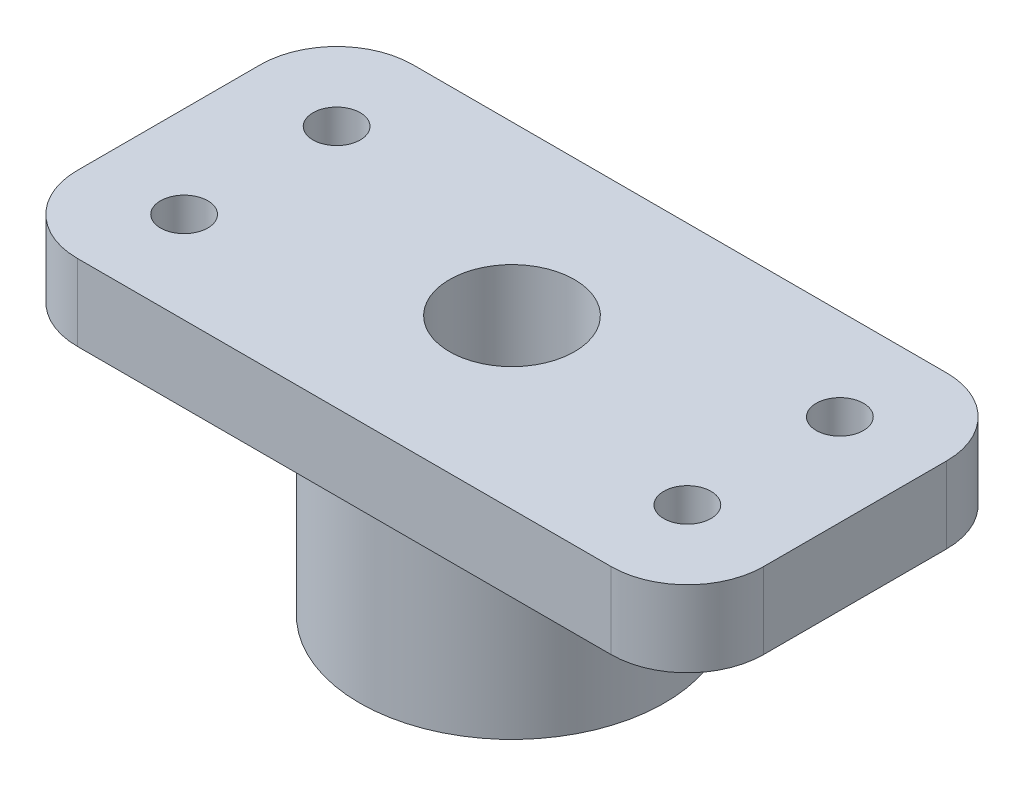
ISO-10303-21;
HEADER;
FILE_DESCRIPTION(('STEP AP214'),'2;1');
FILE_NAME('part.step','',(''),(''),'','','');
FILE_SCHEMA(('AUTOMOTIVE_DESIGN { 1 0 10303 214 1 1 1 1 }'));
ENDSEC;
DATA;
#1=APPLICATION_CONTEXT('core data for automotive mechanical design processes');
#2=APPLICATION_PROTOCOL_DEFINITION('international standard','automotive_design',2000,#1);
#3=PRODUCT_CONTEXT('',#1,'mechanical');
#4=PRODUCT('Part','Part','',(#3));
#5=PRODUCT_RELATED_PRODUCT_CATEGORY('part','',(#4));
#6=PRODUCT_DEFINITION_FORMATION('','',#4);
#7=PRODUCT_DEFINITION_CONTEXT('part definition',#1,'design');
#8=PRODUCT_DEFINITION('design','',#6,#7);
#9=PRODUCT_DEFINITION_SHAPE('','',#8);
#10=(LENGTH_UNIT() NAMED_UNIT(*) SI_UNIT(.MILLI.,.METRE.));
#11=(NAMED_UNIT(*) PLANE_ANGLE_UNIT() SI_UNIT($,.RADIAN.));
#12=(NAMED_UNIT(*) SI_UNIT($,.STERADIAN.) SOLID_ANGLE_UNIT());
#13=UNCERTAINTY_MEASURE_WITH_UNIT(LENGTH_MEASURE(1.E-05),#10,'distance_accuracy_value','');
#14=(GEOMETRIC_REPRESENTATION_CONTEXT(3) GLOBAL_UNCERTAINTY_ASSIGNED_CONTEXT((#13)) GLOBAL_UNIT_ASSIGNED_CONTEXT((#10,
#11,#12)) REPRESENTATION_CONTEXT('',''));
#15=CARTESIAN_POINT('',(0.,0.,0.));
#16=DIRECTION('',(0.,0.,1.));
#17=DIRECTION('',(1.,0.,0.));
#18=AXIS2_PLACEMENT_3D('',#15,#16,#17);
#19=CARTESIAN_POINT('',(0.,0.,0.));
#20=DIRECTION('',(0.,1.,0.));
#21=DIRECTION('',(0.,0.,1.));
#22=AXIS2_PLACEMENT_3D('',#19,#20,#21);
#23=PLANE('',#22);
#24=CARTESIAN_POINT('',(0.,0.,0.));
#25=DIRECTION('',(0.,-1.,0.));
#26=DIRECTION('',(0.,0.,-1.));
#27=AXIS2_PLACEMENT_3D('',#24,#25,#26);
#28=CIRCLE('',#27,4.1);
#29=CARTESIAN_POINT('',(0.,0.,-4.1));
#30=VERTEX_POINT('',#29);
#31=EDGE_CURVE('E164',#30,#30,#28,.T.);
#32=ORIENTED_EDGE('',*,*,#31,.F.);
#33=EDGE_LOOP('',(#32));
#34=FACE_BOUND('',#33,.T.);
#35=CARTESIAN_POINT('',(0.,0.,0.));
#36=DIRECTION('',(0.,1.,0.));
#37=DIRECTION('',(0.,0.,1.));
#38=AXIS2_PLACEMENT_3D('',#35,#36,#37);
#39=CIRCLE('',#38,10.);
#40=CARTESIAN_POINT('',(0.,0.,10.));
#41=VERTEX_POINT('',#40);
#42=EDGE_CURVE('E127',#41,#41,#39,.T.);
#43=ORIENTED_EDGE('',*,*,#42,.F.);
#44=EDGE_LOOP('',(#43));
#45=FACE_BOUND('',#44,.T.);
#46=ADVANCED_FACE('F32',(#34,#45),#23,.F.);
#47=CARTESIAN_POINT('',(0.,12.,0.));
#48=DIRECTION('',(0.,-1.,0.));
#49=DIRECTION('',(0.,0.,-1.));
#50=AXIS2_PLACEMENT_3D('',#47,#48,#49);
#51=CYLINDRICAL_SURFACE('',#50,10.);
#52=CARTESIAN_POINT('',(0.,12.,0.));
#53=DIRECTION('',(0.,1.,0.));
#54=DIRECTION('',(0.,0.,1.));
#55=AXIS2_PLACEMENT_3D('',#52,#53,#54);
#56=CIRCLE('',#55,10.);
#57=CARTESIAN_POINT('',(0.,12.,10.));
#58=VERTEX_POINT('',#57);
#59=EDGE_CURVE('E112',#58,#58,#56,.T.);
#60=ORIENTED_EDGE('',*,*,#59,.F.);
#61=EDGE_LOOP('',(#60));
#62=FACE_BOUND('',#61,.T.);
#63=ORIENTED_EDGE('',*,*,#42,.T.);
#64=EDGE_LOOP('',(#63));
#65=FACE_BOUND('',#64,.T.);
#66=ADVANCED_FACE('F228',(#62,#65),#51,.T.);
#67=CARTESIAN_POINT('',(0.,12.,0.));
#68=DIRECTION('',(0.,-1.,0.));
#69=DIRECTION('',(0.,0.,-1.));
#70=AXIS2_PLACEMENT_3D('',#67,#68,#69);
#71=PLANE('',#70);
#72=CARTESIAN_POINT('',(16.5,12.,-5.));
#73=DIRECTION('',(0.,-1.,0.));
#74=DIRECTION('',(0.,0.,-1.));
#75=AXIS2_PLACEMENT_3D('',#72,#73,#74);
#76=CIRCLE('',#75,1.55);
#77=CARTESIAN_POINT('',(16.5,12.,-6.55000000000001));
#78=VERTEX_POINT('',#77);
#79=EDGE_CURVE('E184',#78,#78,#76,.T.);
#80=ORIENTED_EDGE('',*,*,#79,.F.);
#81=EDGE_LOOP('',(#80));
#82=FACE_BOUND('',#81,.T.);
#83=CARTESIAN_POINT('',(16.5,12.,5.));
#84=DIRECTION('',(0.,-1.,0.));
#85=DIRECTION('',(0.,0.,-1.));
#86=AXIS2_PLACEMENT_3D('',#83,#84,#85);
#87=CIRCLE('',#86,1.55);
#88=CARTESIAN_POINT('',(16.5,12.,3.44999999999999));
#89=VERTEX_POINT('',#88);
#90=EDGE_CURVE('E174',#89,#89,#87,.T.);
#91=ORIENTED_EDGE('',*,*,#90,.F.);
#92=EDGE_LOOP('',(#91));
#93=FACE_BOUND('',#92,.T.);
#94=CARTESIAN_POINT('',(-16.5,12.,-5.));
#95=DIRECTION('',(0.,-1.,0.));
#96=DIRECTION('',(0.,0.,-1.));
#97=AXIS2_PLACEMENT_3D('',#94,#95,#96);
#98=CIRCLE('',#97,1.55);
#99=CARTESIAN_POINT('',(-16.5,12.,-6.55));
#100=VERTEX_POINT('',#99);
#101=EDGE_CURVE('E171',#100,#100,#98,.T.);
#102=ORIENTED_EDGE('',*,*,#101,.F.);
#103=EDGE_LOOP('',(#102));
#104=FACE_BOUND('',#103,.T.);
#105=CARTESIAN_POINT('',(-16.5,12.,5.));
#106=DIRECTION('',(0.,-1.,0.));
#107=DIRECTION('',(0.,0.,-1.));
#108=AXIS2_PLACEMENT_3D('',#105,#106,#107);
#109=CIRCLE('',#108,1.55);
#110=CARTESIAN_POINT('',(-16.5,12.,3.45));
#111=VERTEX_POINT('',#110);
#112=EDGE_CURVE('E168',#111,#111,#109,.T.);
#113=ORIENTED_EDGE('',*,*,#112,.F.);
#114=EDGE_LOOP('',(#113));
#115=FACE_BOUND('',#114,.T.);
#116=DIRECTION('',(0.,0.,1.));
#117=VECTOR('',#116,1.);
#118=CARTESIAN_POINT('',(-22.5,12.,-11.));
#119=LINE('',#118,#117);
#120=CARTESIAN_POINT('',(-22.5,12.,-6.));
#121=VERTEX_POINT('',#120);
#122=CARTESIAN_POINT('',(-22.5,12.,6.));
#123=VERTEX_POINT('',#122);
#124=EDGE_CURVE('E163',#121,#123,#119,.T.);
#125=ORIENTED_EDGE('',*,*,#124,.F.);
#126=CARTESIAN_POINT('',(-17.5,12.,-6.));
#127=DIRECTION('',(0.,-1.,0.));
#128=DIRECTION('',(0.,0.,-1.));
#129=AXIS2_PLACEMENT_3D('',#126,#127,#128);
#130=CIRCLE('',#129,5.);
#131=CARTESIAN_POINT('',(-17.5,12.,-11.));
#132=VERTEX_POINT('',#131);
#133=EDGE_CURVE('E56',#121,#132,#130,.T.);
#134=ORIENTED_EDGE('',*,*,#133,.T.);
#135=DIRECTION('',(-1.,0.,0.));
#136=VECTOR('',#135,1.);
#137=CARTESIAN_POINT('',(22.5,12.,-11.));
#138=LINE('',#137,#136);
#139=CARTESIAN_POINT('',(17.5,12.,-11.));
#140=VERTEX_POINT('',#139);
#141=EDGE_CURVE('E110',#140,#132,#138,.T.);
#142=ORIENTED_EDGE('',*,*,#141,.F.);
#143=CARTESIAN_POINT('',(17.5,12.,-6.));
#144=DIRECTION('',(0.,-1.,0.));
#145=DIRECTION('',(0.,0.,-1.));
#146=AXIS2_PLACEMENT_3D('',#143,#144,#145);
#147=CIRCLE('',#146,5.);
#148=CARTESIAN_POINT('',(22.5,12.,-6.));
#149=VERTEX_POINT('',#148);
#150=EDGE_CURVE('E100',#140,#149,#147,.T.);
#151=ORIENTED_EDGE('',*,*,#150,.T.);
#152=DIRECTION('',(0.,0.,-1.));
#153=VECTOR('',#152,1.);
#154=CARTESIAN_POINT('',(22.5,12.,-11.));
#155=LINE('',#154,#153);
#156=CARTESIAN_POINT('',(22.5,12.,5.99999999999999));
#157=VERTEX_POINT('',#156);
#158=EDGE_CURVE('E117',#157,#149,#155,.T.);
#159=ORIENTED_EDGE('',*,*,#158,.F.);
#160=CARTESIAN_POINT('',(17.5,12.,5.99999999999999));
#161=DIRECTION('',(0.,-1.,0.));
#162=DIRECTION('',(0.,0.,-1.));
#163=AXIS2_PLACEMENT_3D('',#160,#161,#162);
#164=CIRCLE('',#163,5.);
#165=CARTESIAN_POINT('',(17.5,12.,11.));
#166=VERTEX_POINT('',#165);
#167=EDGE_CURVE('E136',#157,#166,#164,.T.);
#168=ORIENTED_EDGE('',*,*,#167,.T.);
#169=DIRECTION('',(1.,0.,0.));
#170=VECTOR('',#169,1.);
#171=CARTESIAN_POINT('',(22.5,12.,11.));
#172=LINE('',#171,#170);
#173=CARTESIAN_POINT('',(-17.5,12.,11.));
#174=VERTEX_POINT('',#173);
#175=EDGE_CURVE('E121',#174,#166,#172,.T.);
#176=ORIENTED_EDGE('',*,*,#175,.F.);
#177=CARTESIAN_POINT('',(-17.5,12.,6.));
#178=DIRECTION('',(0.,-1.,0.));
#179=DIRECTION('',(0.,0.,-1.));
#180=AXIS2_PLACEMENT_3D('',#177,#178,#179);
#181=CIRCLE('',#180,5.);
#182=EDGE_CURVE('E147',#174,#123,#181,.T.);
#183=ORIENTED_EDGE('',*,*,#182,.T.);
#184=EDGE_LOOP('',(#125,#134,#142,#151,#159,#168,#176,#183));
#185=FACE_BOUND('',#184,.T.);
#186=ORIENTED_EDGE('',*,*,#59,.T.);
#187=EDGE_LOOP('',(#186));
#188=FACE_BOUND('',#187,.T.);
#189=ADVANCED_FACE('F114',(#82,#93,#104,#115,#185,#188),#71,.T.);
#190=CARTESIAN_POINT('',(-22.5,17.,-11.));
#191=DIRECTION('',(1.,0.,0.));
#192=DIRECTION('',(0.,0.,-1.));
#193=AXIS2_PLACEMENT_3D('',#190,#191,#192);
#194=PLANE('',#193);
#195=DIRECTION('',(0.,0.,1.));
#196=VECTOR('',#195,1.);
#197=CARTESIAN_POINT('',(-22.5,17.,-11.));
#198=LINE('',#197,#196);
#199=CARTESIAN_POINT('',(-22.5,17.,-6.));
#200=VERTEX_POINT('',#199);
#201=CARTESIAN_POINT('',(-22.5,17.,6.));
#202=VERTEX_POINT('',#201);
#203=EDGE_CURVE('E116',#200,#202,#198,.T.);
#204=ORIENTED_EDGE('',*,*,#203,.F.);
#205=DIRECTION('',(0.,-1.,0.));
#206=VECTOR('',#205,1.);
#207=CARTESIAN_POINT('',(-22.5,17.,-6.));
#208=LINE('',#207,#206);
#209=EDGE_CURVE('E155',#200,#121,#208,.T.);
#210=ORIENTED_EDGE('',*,*,#209,.T.);
#211=ORIENTED_EDGE('',*,*,#124,.T.);
#212=DIRECTION('',(0.,-1.,0.));
#213=VECTOR('',#212,1.);
#214=CARTESIAN_POINT('',(-22.5,17.,6.));
#215=LINE('',#214,#213);
#216=EDGE_CURVE('E150',#123,#202,#215,.F.);
#217=ORIENTED_EDGE('',*,*,#216,.T.);
#218=EDGE_LOOP('',(#204,#210,#211,#217));
#219=FACE_BOUND('',#218,.T.);
#220=ADVANCED_FACE('F215',(#219),#194,.F.);
#221=CARTESIAN_POINT('',(22.5,17.,11.));
#222=DIRECTION('',(0.,0.,-1.));
#223=DIRECTION('',(-1.,0.,0.));
#224=AXIS2_PLACEMENT_3D('',#221,#222,#223);
#225=PLANE('',#224);
#226=DIRECTION('',(1.,0.,0.));
#227=VECTOR('',#226,1.);
#228=CARTESIAN_POINT('',(22.5,17.,11.));
#229=LINE('',#228,#227);
#230=CARTESIAN_POINT('',(-17.5,17.,11.));
#231=VERTEX_POINT('',#230);
#232=CARTESIAN_POINT('',(17.5,17.,11.));
#233=VERTEX_POINT('',#232);
#234=EDGE_CURVE('E119',#231,#233,#229,.T.);
#235=ORIENTED_EDGE('',*,*,#234,.F.);
#236=DIRECTION('',(0.,-1.,0.));
#237=VECTOR('',#236,1.);
#238=CARTESIAN_POINT('',(-17.5,17.,11.));
#239=LINE('',#238,#237);
#240=EDGE_CURVE('E144',#231,#174,#239,.T.);
#241=ORIENTED_EDGE('',*,*,#240,.T.);
#242=ORIENTED_EDGE('',*,*,#175,.T.);
#243=DIRECTION('',(0.,-1.,0.));
#244=VECTOR('',#243,1.);
#245=CARTESIAN_POINT('',(17.5,17.,11.));
#246=LINE('',#245,#244);
#247=EDGE_CURVE('E139',#166,#233,#246,.F.);
#248=ORIENTED_EDGE('',*,*,#247,.T.);
#249=EDGE_LOOP('',(#235,#241,#242,#248));
#250=FACE_BOUND('',#249,.T.);
#251=ADVANCED_FACE('F198',(#250),#225,.F.);
#252=CARTESIAN_POINT('',(22.5,17.,-11.));
#253=DIRECTION('',(-1.,0.,0.));
#254=DIRECTION('',(0.,0.,1.));
#255=AXIS2_PLACEMENT_3D('',#252,#253,#254);
#256=PLANE('',#255);
#257=DIRECTION('',(0.,0.,-1.));
#258=VECTOR('',#257,1.);
#259=CARTESIAN_POINT('',(22.5,17.,-11.));
#260=LINE('',#259,#258);
#261=CARTESIAN_POINT('',(22.5,17.,5.99999999999999));
#262=VERTEX_POINT('',#261);
#263=CARTESIAN_POINT('',(22.5,17.,-6.));
#264=VERTEX_POINT('',#263);
#265=EDGE_CURVE('E192',#262,#264,#260,.T.);
#266=ORIENTED_EDGE('',*,*,#265,.F.);
#267=DIRECTION('',(0.,-1.,0.));
#268=VECTOR('',#267,1.);
#269=CARTESIAN_POINT('',(22.5,17.,5.99999999999999));
#270=LINE('',#269,#268);
#271=EDGE_CURVE('E133',#262,#157,#270,.T.);
#272=ORIENTED_EDGE('',*,*,#271,.T.);
#273=ORIENTED_EDGE('',*,*,#158,.T.);
#274=DIRECTION('',(0.,-1.,0.));
#275=VECTOR('',#274,1.);
#276=CARTESIAN_POINT('',(22.5,17.,-6.));
#277=LINE('',#276,#275);
#278=EDGE_CURVE('E106',#149,#264,#277,.F.);
#279=ORIENTED_EDGE('',*,*,#278,.T.);
#280=EDGE_LOOP('',(#266,#272,#273,#279));
#281=FACE_BOUND('',#280,.T.);
#282=ADVANCED_FACE('F209',(#281),#256,.F.);
#283=CARTESIAN_POINT('',(22.5,17.,-11.));
#284=DIRECTION('',(0.,0.,1.));
#285=DIRECTION('',(1.,0.,0.));
#286=AXIS2_PLACEMENT_3D('',#283,#284,#285);
#287=PLANE('',#286);
#288=ORIENTED_EDGE('',*,*,#141,.T.);
#289=DIRECTION('',(0.,-1.,0.));
#290=VECTOR('',#289,1.);
#291=CARTESIAN_POINT('',(-17.5,17.,-11.));
#292=LINE('',#291,#290);
#293=CARTESIAN_POINT('',(-17.5,17.,-11.));
#294=VERTEX_POINT('',#293);
#295=EDGE_CURVE('E41',#132,#294,#292,.F.);
#296=ORIENTED_EDGE('',*,*,#295,.T.);
#297=DIRECTION('',(-1.,0.,0.));
#298=VECTOR('',#297,1.);
#299=CARTESIAN_POINT('',(22.5,17.,-11.));
#300=LINE('',#299,#298);
#301=CARTESIAN_POINT('',(17.5,17.,-11.));
#302=VERTEX_POINT('',#301);
#303=EDGE_CURVE('E111',#302,#294,#300,.T.);
#304=ORIENTED_EDGE('',*,*,#303,.F.);
#305=DIRECTION('',(0.,-1.,0.));
#306=VECTOR('',#305,1.);
#307=CARTESIAN_POINT('',(17.5,17.,-11.));
#308=LINE('',#307,#306);
#309=EDGE_CURVE('E104',#302,#140,#308,.T.);
#310=ORIENTED_EDGE('',*,*,#309,.T.);
#311=EDGE_LOOP('',(#288,#296,#304,#310));
#312=FACE_BOUND('',#311,.T.);
#313=ADVANCED_FACE('F109',(#312),#287,.F.);
#314=CARTESIAN_POINT('',(0.,17.,0.));
#315=DIRECTION('',(0.,-1.,0.));
#316=DIRECTION('',(0.,0.,-1.));
#317=AXIS2_PLACEMENT_3D('',#314,#315,#316);
#318=PLANE('',#317);
#319=CARTESIAN_POINT('',(16.5,17.,-5.));
#320=DIRECTION('',(0.,-1.,0.));
#321=DIRECTION('',(0.,0.,-1.));
#322=AXIS2_PLACEMENT_3D('',#319,#320,#321);
#323=CIRCLE('',#322,1.55);
#324=CARTESIAN_POINT('',(16.5,17.,-6.55000000000001));
#325=VERTEX_POINT('',#324);
#326=EDGE_CURVE('E36',#325,#325,#323,.T.);
#327=ORIENTED_EDGE('',*,*,#326,.T.);
#328=EDGE_LOOP('',(#327));
#329=FACE_BOUND('',#328,.T.);
#330=CARTESIAN_POINT('',(16.5,17.,5.));
#331=DIRECTION('',(0.,-1.,0.));
#332=DIRECTION('',(0.,0.,-1.));
#333=AXIS2_PLACEMENT_3D('',#330,#331,#332);
#334=CIRCLE('',#333,1.55);
#335=CARTESIAN_POINT('',(16.5,17.,3.44999999999999));
#336=VERTEX_POINT('',#335);
#337=EDGE_CURVE('E172',#336,#336,#334,.T.);
#338=ORIENTED_EDGE('',*,*,#337,.T.);
#339=EDGE_LOOP('',(#338));
#340=FACE_BOUND('',#339,.T.);
#341=CARTESIAN_POINT('',(-16.5,17.,-5.));
#342=DIRECTION('',(0.,-1.,0.));
#343=DIRECTION('',(0.,0.,-1.));
#344=AXIS2_PLACEMENT_3D('',#341,#342,#343);
#345=CIRCLE('',#344,1.55);
#346=CARTESIAN_POINT('',(-16.5,17.,-6.55));
#347=VERTEX_POINT('',#346);
#348=EDGE_CURVE('E169',#347,#347,#345,.T.);
#349=ORIENTED_EDGE('',*,*,#348,.T.);
#350=EDGE_LOOP('',(#349));
#351=FACE_BOUND('',#350,.T.);
#352=CARTESIAN_POINT('',(-16.5,17.,5.));
#353=DIRECTION('',(0.,-1.,0.));
#354=DIRECTION('',(0.,0.,-1.));
#355=AXIS2_PLACEMENT_3D('',#352,#353,#354);
#356=CIRCLE('',#355,1.55);
#357=CARTESIAN_POINT('',(-16.5,17.,3.45));
#358=VERTEX_POINT('',#357);
#359=EDGE_CURVE('E165',#358,#358,#356,.T.);
#360=ORIENTED_EDGE('',*,*,#359,.T.);
#361=EDGE_LOOP('',(#360));
#362=FACE_BOUND('',#361,.T.);
#363=CARTESIAN_POINT('',(0.,17.,0.));
#364=DIRECTION('',(0.,-1.,0.));
#365=DIRECTION('',(0.,0.,-1.));
#366=AXIS2_PLACEMENT_3D('',#363,#364,#365);
#367=CIRCLE('',#366,4.1);
#368=CARTESIAN_POINT('',(0.,17.,-4.1));
#369=VERTEX_POINT('',#368);
#370=EDGE_CURVE('E160',#369,#369,#367,.T.);
#371=ORIENTED_EDGE('',*,*,#370,.T.);
#372=EDGE_LOOP('',(#371));
#373=FACE_BOUND('',#372,.T.);
#374=ORIENTED_EDGE('',*,*,#303,.T.);
#375=CARTESIAN_POINT('',(-17.5,17.,-6.));
#376=DIRECTION('',(0.,-1.,0.));
#377=DIRECTION('',(0.,0.,-1.));
#378=AXIS2_PLACEMENT_3D('',#375,#376,#377);
#379=CIRCLE('',#378,5.);
#380=EDGE_CURVE('E11',#294,#200,#379,.F.);
#381=ORIENTED_EDGE('',*,*,#380,.T.);
#382=ORIENTED_EDGE('',*,*,#203,.T.);
#383=CARTESIAN_POINT('',(-17.5,17.,6.));
#384=DIRECTION('',(0.,-1.,0.));
#385=DIRECTION('',(0.,0.,-1.));
#386=AXIS2_PLACEMENT_3D('',#383,#384,#385);
#387=CIRCLE('',#386,5.);
#388=EDGE_CURVE('E153',#202,#231,#387,.F.);
#389=ORIENTED_EDGE('',*,*,#388,.T.);
#390=ORIENTED_EDGE('',*,*,#234,.T.);
#391=CARTESIAN_POINT('',(17.5,17.,5.99999999999999));
#392=DIRECTION('',(0.,-1.,0.));
#393=DIRECTION('',(0.,0.,-1.));
#394=AXIS2_PLACEMENT_3D('',#391,#392,#393);
#395=CIRCLE('',#394,5.);
#396=EDGE_CURVE('E142',#233,#262,#395,.F.);
#397=ORIENTED_EDGE('',*,*,#396,.T.);
#398=ORIENTED_EDGE('',*,*,#265,.T.);
#399=CARTESIAN_POINT('',(17.5,17.,-6.));
#400=DIRECTION('',(0.,-1.,0.));
#401=DIRECTION('',(0.,0.,-1.));
#402=AXIS2_PLACEMENT_3D('',#399,#400,#401);
#403=CIRCLE('',#402,5.);
#404=EDGE_CURVE('E131',#264,#302,#403,.F.);
#405=ORIENTED_EDGE('',*,*,#404,.T.);
#406=EDGE_LOOP('',(#374,#381,#382,#389,#390,#397,#398,#405));
#407=FACE_BOUND('',#406,.T.);
#408=ADVANCED_FACE('F207',(#329,#340,#351,#362,#373,#407),#318,.F.);
#409=CARTESIAN_POINT('',(17.5,17.,-6.));
#410=DIRECTION('',(0.,-1.,0.));
#411=DIRECTION('',(0.,0.,-1.));
#412=AXIS2_PLACEMENT_3D('',#409,#410,#411);
#413=CYLINDRICAL_SURFACE('',#412,5.);
#414=ORIENTED_EDGE('',*,*,#404,.F.);
#415=ORIENTED_EDGE('',*,*,#278,.F.);
#416=ORIENTED_EDGE('',*,*,#150,.F.);
#417=ORIENTED_EDGE('',*,*,#309,.F.);
#418=EDGE_LOOP('',(#414,#415,#416,#417));
#419=FACE_BOUND('',#418,.T.);
#420=ADVANCED_FACE('F103',(#419),#413,.T.);
#421=CARTESIAN_POINT('',(17.5,17.,5.99999999999999));
#422=DIRECTION('',(0.,-1.,0.));
#423=DIRECTION('',(0.,0.,-1.));
#424=AXIS2_PLACEMENT_3D('',#421,#422,#423);
#425=CYLINDRICAL_SURFACE('',#424,5.);
#426=ORIENTED_EDGE('',*,*,#396,.F.);
#427=ORIENTED_EDGE('',*,*,#247,.F.);
#428=ORIENTED_EDGE('',*,*,#167,.F.);
#429=ORIENTED_EDGE('',*,*,#271,.F.);
#430=EDGE_LOOP('',(#426,#427,#428,#429));
#431=FACE_BOUND('',#430,.T.);
#432=ADVANCED_FACE('F204',(#431),#425,.T.);
#433=CARTESIAN_POINT('',(-17.5,17.,6.));
#434=DIRECTION('',(0.,-1.,0.));
#435=DIRECTION('',(0.,0.,-1.));
#436=AXIS2_PLACEMENT_3D('',#433,#434,#435);
#437=CYLINDRICAL_SURFACE('',#436,5.);
#438=ORIENTED_EDGE('',*,*,#388,.F.);
#439=ORIENTED_EDGE('',*,*,#216,.F.);
#440=ORIENTED_EDGE('',*,*,#182,.F.);
#441=ORIENTED_EDGE('',*,*,#240,.F.);
#442=EDGE_LOOP('',(#438,#439,#440,#441));
#443=FACE_BOUND('',#442,.T.);
#444=ADVANCED_FACE('F219',(#443),#437,.T.);
#445=CARTESIAN_POINT('',(-17.5,17.,-6.));
#446=DIRECTION('',(0.,-1.,0.));
#447=DIRECTION('',(0.,0.,-1.));
#448=AXIS2_PLACEMENT_3D('',#445,#446,#447);
#449=CYLINDRICAL_SURFACE('',#448,5.);
#450=ORIENTED_EDGE('',*,*,#380,.F.);
#451=ORIENTED_EDGE('',*,*,#295,.F.);
#452=ORIENTED_EDGE('',*,*,#133,.F.);
#453=ORIENTED_EDGE('',*,*,#209,.F.);
#454=EDGE_LOOP('',(#450,#451,#452,#453));
#455=FACE_BOUND('',#454,.T.);
#456=ADVANCED_FACE('F34',(#455),#449,.T.);
#457=CARTESIAN_POINT('',(0.,45.,0.));
#458=DIRECTION('',(0.,-1.,0.));
#459=DIRECTION('',(0.,0.,-1.));
#460=AXIS2_PLACEMENT_3D('',#457,#458,#459);
#461=CYLINDRICAL_SURFACE('',#460,4.1);
#462=ORIENTED_EDGE('',*,*,#31,.T.);
#463=EDGE_LOOP('',(#462));
#464=FACE_BOUND('',#463,.T.);
#465=ORIENTED_EDGE('',*,*,#370,.F.);
#466=EDGE_LOOP('',(#465));
#467=FACE_BOUND('',#466,.T.);
#468=ADVANCED_FACE('F225',(#464,#467),#461,.F.);
#469=CARTESIAN_POINT('',(-16.5,57.,5.));
#470=DIRECTION('',(0.,-1.,0.));
#471=DIRECTION('',(0.,0.,-1.));
#472=AXIS2_PLACEMENT_3D('',#469,#470,#471);
#473=CYLINDRICAL_SURFACE('',#472,1.55);
#474=ORIENTED_EDGE('',*,*,#112,.T.);
#475=EDGE_LOOP('',(#474));
#476=FACE_BOUND('',#475,.T.);
#477=ORIENTED_EDGE('',*,*,#359,.F.);
#478=EDGE_LOOP('',(#477));
#479=FACE_BOUND('',#478,.T.);
#480=ADVANCED_FACE('F287',(#476,#479),#473,.F.);
#481=CARTESIAN_POINT('',(-16.5,57.,-5.));
#482=DIRECTION('',(0.,-1.,0.));
#483=DIRECTION('',(0.,0.,-1.));
#484=AXIS2_PLACEMENT_3D('',#481,#482,#483);
#485=CYLINDRICAL_SURFACE('',#484,1.55);
#486=ORIENTED_EDGE('',*,*,#101,.T.);
#487=EDGE_LOOP('',(#486));
#488=FACE_BOUND('',#487,.T.);
#489=ORIENTED_EDGE('',*,*,#348,.F.);
#490=EDGE_LOOP('',(#489));
#491=FACE_BOUND('',#490,.T.);
#492=ADVANCED_FACE('F292',(#488,#491),#485,.F.);
#493=CARTESIAN_POINT('',(16.5,57.,5.));
#494=DIRECTION('',(0.,-1.,0.));
#495=DIRECTION('',(0.,0.,-1.));
#496=AXIS2_PLACEMENT_3D('',#493,#494,#495);
#497=CYLINDRICAL_SURFACE('',#496,1.55);
#498=ORIENTED_EDGE('',*,*,#90,.T.);
#499=EDGE_LOOP('',(#498));
#500=FACE_BOUND('',#499,.T.);
#501=ORIENTED_EDGE('',*,*,#337,.F.);
#502=EDGE_LOOP('',(#501));
#503=FACE_BOUND('',#502,.T.);
#504=ADVANCED_FACE('F299',(#500,#503),#497,.F.);
#505=CARTESIAN_POINT('',(16.5,57.,-5.));
#506=DIRECTION('',(0.,-1.,0.));
#507=DIRECTION('',(0.,0.,-1.));
#508=AXIS2_PLACEMENT_3D('',#505,#506,#507);
#509=CYLINDRICAL_SURFACE('',#508,1.55);
#510=ORIENTED_EDGE('',*,*,#79,.T.);
#511=EDGE_LOOP('',(#510));
#512=FACE_BOUND('',#511,.T.);
#513=ORIENTED_EDGE('',*,*,#326,.F.);
#514=EDGE_LOOP('',(#513));
#515=FACE_BOUND('',#514,.T.);
#516=ADVANCED_FACE('F307',(#512,#515),#509,.F.);
#517=CLOSED_SHELL('',(#46,#66,#189,#220,#251,#282,#313,#408,#420,#432,#444,#456,#468,#480,#492,
#504,#516));
#518=MANIFOLD_SOLID_BREP('B2',#517);
#519=ADVANCED_BREP_SHAPE_REPRESENTATION('',(#18,#518),#14);
#520=SHAPE_DEFINITION_REPRESENTATION(#9,#519);
ENDSEC;
END-ISO-10303-21;
